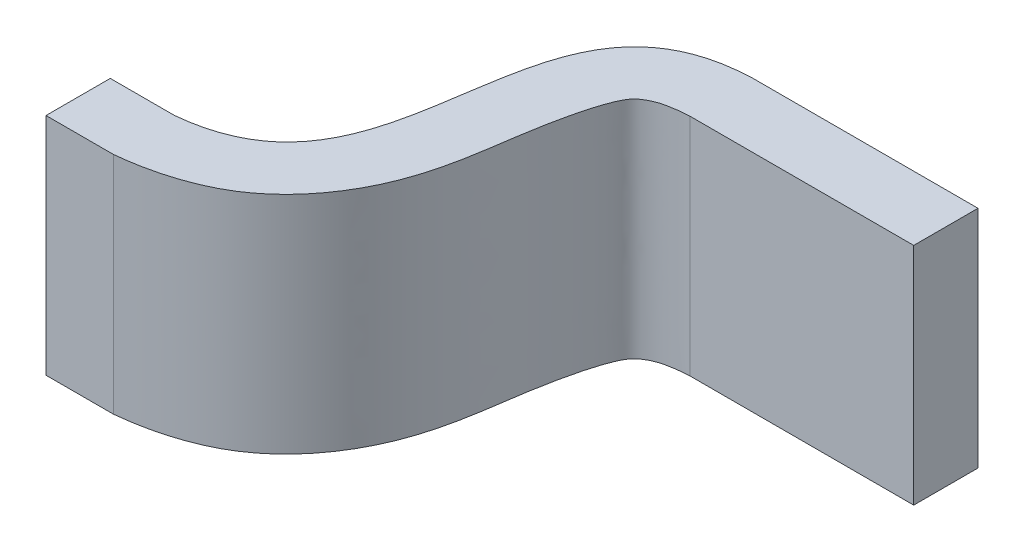
ISO-10303-21;
HEADER;
FILE_DESCRIPTION(('STEP AP214'),'2;1');
FILE_NAME('part.step','',(''),(''),'','','');
FILE_SCHEMA(('AUTOMOTIVE_DESIGN { 1 0 10303 214 1 1 1 1 }'));
ENDSEC;
DATA;
#1=APPLICATION_CONTEXT('core data for automotive mechanical design processes');
#2=APPLICATION_PROTOCOL_DEFINITION('international standard','automotive_design',2000,#1);
#3=PRODUCT_CONTEXT('',#1,'mechanical');
#4=PRODUCT('Part','Part','',(#3));
#5=PRODUCT_RELATED_PRODUCT_CATEGORY('part','',(#4));
#6=PRODUCT_DEFINITION_FORMATION('','',#4);
#7=PRODUCT_DEFINITION_CONTEXT('part definition',#1,'design');
#8=PRODUCT_DEFINITION('design','',#6,#7);
#9=PRODUCT_DEFINITION_SHAPE('','',#8);
#10=(LENGTH_UNIT() NAMED_UNIT(*) SI_UNIT(.MILLI.,.METRE.));
#11=(NAMED_UNIT(*) PLANE_ANGLE_UNIT() SI_UNIT($,.RADIAN.));
#12=(NAMED_UNIT(*) SI_UNIT($,.STERADIAN.) SOLID_ANGLE_UNIT());
#13=UNCERTAINTY_MEASURE_WITH_UNIT(LENGTH_MEASURE(1.E-05),#10,'distance_accuracy_value','');
#14=(GEOMETRIC_REPRESENTATION_CONTEXT(3) GLOBAL_UNCERTAINTY_ASSIGNED_CONTEXT((#13)) GLOBAL_UNIT_ASSIGNED_CONTEXT((#10,
#11,#12)) REPRESENTATION_CONTEXT('',''));
#15=CARTESIAN_POINT('',(0.,0.,0.));
#16=DIRECTION('',(0.,0.,1.));
#17=DIRECTION('',(1.,0.,0.));
#18=AXIS2_PLACEMENT_3D('',#15,#16,#17);
#19=CARTESIAN_POINT('',(0.381074398756027,-3.47690082967439,1.19999985356685));
#20=DIRECTION('',(0.,1.,4.37113882867379E-08));
#21=DIRECTION('',(-1.,0.,0.));
#22=AXIS2_PLACEMENT_3D('',#19,#20,#21);
#23=PLANE('',#22);
#24=DIRECTION('',(-1.,0.,0.));
#25=VECTOR('',#24,1.);
#26=CARTESIAN_POINT('',(8.91607439875603,-3.476900785963,0.199999853566849));
#27=LINE('',#26,#25);
#28=CARTESIAN_POINT('',(8.91607439875603,-3.476900785963,0.199999853566849));
#29=VERTEX_POINT('',#28);
#30=CARTESIAN_POINT('',(8.21957818049203,-3.476900785963,0.199999853566849));
#31=VERTEX_POINT('',#30);
#32=EDGE_CURVE('E11',#29,#31,#27,.T.);
#33=ORIENTED_EDGE('',*,*,#32,.T.);
#34=CARTESIAN_POINT('',(7.42587357560403,-3.47690082967439,1.19999985356685));
#35=CARTESIAN_POINT('',(7.44450696231857,-3.47690082959388,1.19815800024526));
#36=CARTESIAN_POINT('',(7.46308378697548,-3.47690082948649,1.1957012238173));
#37=CARTESIAN_POINT('',(7.50006101029373,-3.47690082921529,1.18949682423011));
#38=CARTESIAN_POINT('',(7.51846094169025,-3.47690082905135,1.18574642673535));
#39=CARTESIAN_POINT('',(7.55510393371643,-3.47690082866298,1.1768614504023));
#40=CARTESIAN_POINT('',(7.57334409155655,-3.47690082843801,1.17171471620827));
#41=CARTESIAN_POINT('',(7.60932052096594,-3.47690082792288,1.15992992349783));
#42=CARTESIAN_POINT('',(7.62705717651152,-3.47690082763277,1.15329303778762));
#43=CARTESIAN_POINT('',(7.66764342416262,-3.47690082686923,1.13582532460973));
#44=CARTESIAN_POINT('',(7.69022170006956,-3.47690082636693,1.12433411949994));
#45=CARTESIAN_POINT('',(7.73311709417893,-3.4769008252108,1.09788489937366));
#46=CARTESIAN_POINT('',(7.75344430120095,-3.47690082455769,1.08294336266544));
#47=CARTESIAN_POINT('',(7.79010917597914,-3.4769008231845,1.05152836561377));
#48=CARTESIAN_POINT('',(7.80663564372868,-3.47690082247389,1.03527166959651));
#49=CARTESIAN_POINT('',(7.83757005773215,-3.47690082096671,1.00079135092782));
#50=CARTESIAN_POINT('',(7.85197241919277,-3.47690082016992,0.98256275412625));
#51=CARTESIAN_POINT('',(7.8802341685402,-3.47690081841041,0.942309972603253));
#52=CARTESIAN_POINT('',(7.89381844801596,-3.47690081743928,0.920093186124081));
#53=CARTESIAN_POINT('',(7.91820429984428,-3.47690081543449,0.87422897098033));
#54=CARTESIAN_POINT('',(7.92900959422008,-3.47690081440092,0.850583508813256));
#55=CARTESIAN_POINT('',(7.94871551674147,-3.47690081220073,0.800248980346848));
#56=CARTESIAN_POINT('',(7.95738403816721,-3.47690081103018,0.773470089068371));
#57=CARTESIAN_POINT('',(7.97210425943558,-3.47690080865782,0.719196833192922));
#58=CARTESIAN_POINT('',(7.97815277621527,-3.47690080745597,0.691701641089337));
#59=CARTESIAN_POINT('',(7.98659346655188,-3.47690080548969,0.646718436338351));
#60=CARTESIAN_POINT('',(7.98950808079972,-3.47690080472924,0.629321297123909));
#61=CARTESIAN_POINT('',(7.99495752836008,-3.47690080320562,0.594464888859919));
#62=CARTESIAN_POINT('',(7.99749227542006,-3.47690080244245,0.577005606618712));
#63=CARTESIAN_POINT('',(8.00258019010342,-3.47690080091635,0.542092659422764));
#64=CARTESIAN_POINT('',(8.00513335408043,-3.47690080015343,0.524638994034043));
#65=CARTESIAN_POINT('',(8.01067664140315,-3.47690079863081,0.48980544840022));
#66=CARTESIAN_POINT('',(8.01366664660187,-3.47690079787111,0.472425549508169));
#67=CARTESIAN_POINT('',(8.02154183196176,-3.47690079601736,0.430016740032558));
#68=CARTESIAN_POINT('',(8.026677647503,-3.47690079492524,0.405032011816052));
#69=CARTESIAN_POINT('',(8.03549422069925,-3.47690079329834,0.36781273498558));
#70=CARTESIAN_POINT('',(8.03861929488698,-3.47690079275781,0.35544681434155));
#71=CARTESIAN_POINT('',(8.04538178604434,-3.47690079168298,0.33085792341073));
#72=CARTESIAN_POINT('',(8.04901891512481,-3.47690079114867,0.318634876950398));
#73=CARTESIAN_POINT('',(8.05549287491962,-3.47690079030677,0.299373221215939));
#74=CARTESIAN_POINT('',(8.05805542449796,-3.47690078999518,0.292243807444688));
#75=CARTESIAN_POINT('',(8.06363353655652,-3.47690078937994,0.278171719353253));
#76=CARTESIAN_POINT('',(8.06664841291152,-3.47690078907628,0.27122878066356));
#77=CARTESIAN_POINT('',(8.07291634166038,-3.47690078854217,0.258999768411459));
#78=CARTESIAN_POINT('',(8.07602245220972,-3.47690078830855,0.253644591727609));
#79=CARTESIAN_POINT('',(8.08295261429228,-3.47690078789956,0.24431585073112));
#80=CARTESIAN_POINT('',(8.08664880136107,-3.47690078772056,0.240253829951384));
#81=CARTESIAN_POINT('',(8.09609777114538,-3.47690078736822,0.232075819782313));
#82=CARTESIAN_POINT('',(8.10213521795419,-3.47690078721245,0.228303905554504));
#83=CARTESIAN_POINT('',(8.11135187843241,-3.47690078697539,0.223112945284578));
#84=CARTESIAN_POINT('',(8.11443840401739,-3.47690078689613,0.221466013892202));
#85=CARTESIAN_POINT('',(8.12072868843963,-3.47690078677323,0.218417225329415));
#86=CARTESIAN_POINT('',(8.12393212492761,-3.4769007867295,0.217014747998717));
#87=CARTESIAN_POINT('',(8.1330523200996,-3.4769007866004,0.21346489598315));
#88=CARTESIAN_POINT('',(8.13908573097743,-3.47690078650972,0.211621552848283));
#89=CARTESIAN_POINT('',(8.14885449437696,-3.4769007863772,0.209137060916209));
#90=CARTESIAN_POINT('',(8.15254767389704,-3.4769007863303,0.208309546645722));
#91=CARTESIAN_POINT('',(8.15996325473587,-3.47690078625616,0.206799511724329));
#92=CARTESIAN_POINT('',(8.16368565174552,-3.47690078622893,0.206116970094036));
#93=CARTESIAN_POINT('',(8.17604847837331,-3.47690078614263,0.204031929793531));
#94=CARTESIAN_POINT('',(8.18472828231269,-3.47690078608874,0.20286096389716));
#95=CARTESIAN_POINT('',(8.19777924698608,-3.47690078602721,0.201476448842085));
#96=CARTESIAN_POINT('',(8.20213187370674,-3.47690078600992,0.201077075020748));
#97=CARTESIAN_POINT('',(8.2108475193358,-3.4769007859817,0.200423844313514));
#98=CARTESIAN_POINT('',(8.21521053727932,-3.47690078597078,0.200169974408029));
#99=CARTESIAN_POINT('',(8.21957818049203,-3.476900785963,0.199999853566849));
#100=B_SPLINE_CURVE_WITH_KNOTS('',3,(#34,#35,#36,#37,#38,#39,#40,#41,#42,#43,#44,#45,#46,#47,
#48,#49,#50,#51,#52,#53,#54,#55,#56,#57,#58,#59,#60,#61,#62,#63,#64,#65,#66,#67,#68,#69,#70,#71,
#72,#73,#74,#75,#76,#77,#78,#79,#80,#81,#82,#83,#84,#85,#86,#87,#88,#89,#90,#91,#92,#93,#94,#95,
#96,#97,#98,#99),.UNSPECIFIED.,.F.,.F.,(4,2,2,2,2,2,2,2,2,2,2,2,2,2,2,2,2,2,2,2,2,2,2,2,2,2,2,2,
2,2,2,2,4),(0.,0.0561681589095689,0.112457534383133,0.169253578612362,0.226005077906876,
0.301715004036535,0.377070566345992,0.446424912055148,0.515958475234814,0.593880428548582,
0.671697467408242,0.755964517163008,0.840333658382208,0.893247792631838,0.946173923407369,
0.999089848164161,1.05199148781442,1.12847716172405,1.16673541076623,1.20497223539783,
1.22769072756634,1.25037510056687,1.26886797593494,1.28517999290264,1.30634908955326,
1.31685139211729,1.32732665061525,1.34619861049413,1.3575513722042,1.36890248990408,
1.39515927363249,1.40827024085607,1.42138003473644),.UNSPECIFIED.);
#101=CARTESIAN_POINT('',(7.42587357560403,-3.47690082967439,1.19999985356685));
#102=VERTEX_POINT('',#101);
#103=EDGE_CURVE('E187',#102,#31,#100,.T.);
#104=ORIENTED_EDGE('',*,*,#103,.F.);
#105=DIRECTION('',(1.,0.,0.));
#106=VECTOR('',#105,1.);
#107=CARTESIAN_POINT('',(7.21607439875603,-3.47690082967439,1.19999985356685));
#108=LINE('',#107,#106);
#109=CARTESIAN_POINT('',(7.21607439875603,-3.47690082967439,1.19999985356685));
#110=VERTEX_POINT('',#109);
#111=EDGE_CURVE('E163',#110,#102,#108,.T.);
#112=ORIENTED_EDGE('',*,*,#111,.F.);
#113=DIRECTION('',(0.,4.37113878426487E-08,-0.999999999999999));
#114=VECTOR('',#113,1.);
#115=CARTESIAN_POINT('',(7.21607439875603,-3.47690082967439,1.19999985356685));
#116=LINE('',#115,#114);
#117=CARTESIAN_POINT('',(7.21607439875603,-3.47690082093211,0.999999853566849));
#118=VERTEX_POINT('',#117);
#119=EDGE_CURVE('E155',#110,#118,#116,.T.);
#120=ORIENTED_EDGE('',*,*,#119,.T.);
#121=DIRECTION('',(1.,0.,0.));
#122=VECTOR('',#121,1.);
#123=CARTESIAN_POINT('',(7.21607439875603,-3.47690082093211,0.999999853566849));
#124=LINE('',#123,#122);
#125=CARTESIAN_POINT('',(7.41607439875603,-3.47690082093211,0.999999853566849));
#126=VERTEX_POINT('',#125);
#127=EDGE_CURVE('E148',#118,#126,#124,.T.);
#128=ORIENTED_EDGE('',*,*,#127,.T.);
#129=CARTESIAN_POINT('',(7.41607439875603,-3.47690082093211,0.999999853566849));
#130=CARTESIAN_POINT('',(7.43817018222186,-3.47690082083689,0.997821363378806));
#131=CARTESIAN_POINT('',(7.46028248507753,-3.4769008206928,0.994524992319807));
#132=CARTESIAN_POINT('',(7.50409640205193,-3.47690082027531,0.984973999806054));
#133=CARTESIAN_POINT('',(7.52579079095056,-3.4769008200005,0.978687133446074));
#134=CARTESIAN_POINT('',(7.56323568888655,-3.476900819368,0.964217061903684));
#135=CARTESIAN_POINT('',(7.57925238017961,-3.47690081904135,0.956744157681286));
#136=CARTESIAN_POINT('',(7.60984744345818,-3.47690081828303,0.939395910983818));
#137=CARTESIAN_POINT('',(7.62443222356208,-3.47690081785186,0.929532028551955));
#138=CARTESIAN_POINT('',(7.65127355429857,-3.47690081690445,0.907857820702244));
#139=CARTESIAN_POINT('',(7.66359189311382,-3.47690081639156,0.896124080689934));
#140=CARTESIAN_POINT('',(7.68623973177649,-3.47690081528685,0.870851202194944));
#141=CARTESIAN_POINT('',(7.69656581930069,-3.4769008146949,0.857309032186524));
#142=CARTESIAN_POINT('',(7.7288599653506,-3.47690081254812,0.808196393991892));
#143=CARTESIAN_POINT('',(7.74578219402698,-3.47690081085059,0.769361408858454));
#144=CARTESIAN_POINT('',(7.76851555094968,-3.47690080782166,0.700067620687222));
#145=CARTESIAN_POINT('',(7.77606917338715,-3.47690080650928,0.670043871769164));
#146=CARTESIAN_POINT('',(7.78894702253641,-3.476900803861,0.609458291277652));
#147=CARTESIAN_POINT('',(7.79426746653087,-3.47690080252507,0.578895637360987));
#148=CARTESIAN_POINT('',(7.80737252762368,-3.47690079894623,0.497021351625422));
#149=CARTESIAN_POINT('',(7.81440202819144,-3.47690079669872,0.445604528778748));
#150=CARTESIAN_POINT('',(7.82797469405163,-3.47690079334914,0.368975045837081));
#151=CARTESIAN_POINT('',(7.83300116933564,-3.47690079223664,0.343524079365539));
#152=CARTESIAN_POINT('',(7.8450377099592,-3.47690079003342,0.293120201610463));
#153=CARTESIAN_POINT('',(7.85204451695726,-3.47690078894266,0.268166543683048));
#154=CARTESIAN_POINT('',(7.86967882133572,-3.4769007867616,0.218269493752244));
#155=CARTESIAN_POINT('',(7.88044603179669,-3.47690078567323,0.19337055401301));
#156=CARTESIAN_POINT('',(7.90028149828643,-3.47690078413505,0.158181114031214));
#157=CARTESIAN_POINT('',(7.90747873152155,-3.47690078363948,0.146843820328248));
#158=CARTESIAN_POINT('',(7.92319628097518,-3.47690078269053,0.125134406221759));
#159=CARTESIAN_POINT('',(7.93171533183735,-3.47690078223712,0.114761377771714));
#160=CARTESIAN_POINT('',(7.95305079729199,-3.47690078124645,0.0920974605824842));
#161=CARTESIAN_POINT('',(7.96636683173803,-3.47690078072935,0.0802678988908218));
#162=CARTESIAN_POINT('',(7.9949416924925,-3.47690077980915,0.0592160823492707));
#163=CARTESIAN_POINT('',(8.01020376688035,-3.47690077940623,0.0499982715306271));
#164=CARTESIAN_POINT('',(8.04269320473982,-3.47690077870131,0.03387168882075));
#165=CARTESIAN_POINT('',(8.059976592337,-3.47690077840435,0.0270780092305779));
#166=CARTESIAN_POINT('',(8.09534530324317,-3.47690077791998,0.0159969269530985));
#167=CARTESIAN_POINT('',(8.11343240408648,-3.47690077773283,0.011715410814513));
#168=CARTESIAN_POINT('',(8.14567062680494,-3.4769007774817,0.00597036540082552));
#169=CARTESIAN_POINT('',(8.15975136088267,-3.47690077739915,0.00408168117578882));
#170=CARTESIAN_POINT('',(8.18791264005314,-3.4769007772789,0.00133069078066405));
#171=CARTESIAN_POINT('',(8.2019924559053,-3.47690077724089,0.000461089362856563));
#172=CARTESIAN_POINT('',(8.21607439875606,-3.47690077722073,-1.46433151940948E-07));
#173=B_SPLINE_CURVE_WITH_KNOTS('',3,(#129,#130,#131,#132,#133,#134,#135,#136,#137,#138,#139,
#140,#141,#142,#143,#144,#145,#146,#147,#148,#149,#150,#151,#152,#153,#154,#155,#156,#157,#158,
#159,#160,#161,#162,#163,#164,#165,#166,#167,#168,#169,#170,#171,#172),.UNSPECIFIED.,.F.,.F.,(4,
2,2,2,2,2,2,2,2,2,2,2,2,2,2,2,2,2,2,2,2,4),(0.,0.0667821137090817,0.134301214684023,
0.18712850882399,0.239707439757743,0.29051873145293,0.341416294675054,0.466712259088969,
0.559563019654506,0.652570428897919,0.808245450373593,0.886023921415194,0.963675157190786,
1.04458784966541,1.08478909463836,1.12495209032637,1.17807587168456,1.23128951042009,
1.2867700351769,1.34238004906254,1.38496468867344,1.42724258099922),.UNSPECIFIED.);
#174=CARTESIAN_POINT('',(8.21607439875603,-3.47690077722073,-1.46433150760572E-07));
#175=VERTEX_POINT('',#174);
#176=EDGE_CURVE('E100',#126,#175,#173,.T.);
#177=ORIENTED_EDGE('',*,*,#176,.T.);
#178=DIRECTION('',(1.,0.,0.));
#179=VECTOR('',#178,1.);
#180=CARTESIAN_POINT('',(8.21607439875603,-3.47690077722073,-1.46433150760572E-07));
#181=LINE('',#180,#179);
#182=CARTESIAN_POINT('',(8.91607439875603,-3.47690077722073,-1.46433150760572E-07));
#183=VERTEX_POINT('',#182);
#184=EDGE_CURVE('E94',#175,#183,#181,.T.);
#185=ORIENTED_EDGE('',*,*,#184,.T.);
#186=DIRECTION('',(0.,4.37113900630947E-08,-0.999999999999999));
#187=VECTOR('',#186,1.);
#188=CARTESIAN_POINT('',(8.91607439875603,-3.476900785963,0.199999853566849));
#189=LINE('',#188,#187);
#190=EDGE_CURVE('E195',#29,#183,#189,.T.);
#191=ORIENTED_EDGE('',*,*,#190,.F.);
#192=EDGE_LOOP('',(#33,#104,#112,#120,#128,#177,#185,#191));
#193=FACE_BOUND('',#192,.T.);
#194=ADVANCED_FACE('F17',(#193),#23,.F.);
#195=CARTESIAN_POINT('',(8.91607439875603,-0.126900829674392,1.2));
#196=DIRECTION('',(-1.,0.,0.));
#197=DIRECTION('',(0.,-1.,-4.37113882867379E-08));
#198=AXIS2_PLACEMENT_3D('',#195,#196,#197);
#199=PLANE('',#198);
#200=DIRECTION('',(0.,-0.999999999999999,-4.37113886356658E-08));
#201=VECTOR('',#200,1.);
#202=CARTESIAN_POINT('',(8.91607439875603,-2.77690078596301,0.199999884164821));
#203=LINE('',#202,#201);
#204=CARTESIAN_POINT('',(8.91607439875603,-2.776900785963,0.199999884164821));
#205=VERTEX_POINT('',#204);
#206=EDGE_CURVE('E25',#205,#29,#203,.T.);
#207=ORIENTED_EDGE('',*,*,#206,.T.);
#208=ORIENTED_EDGE('',*,*,#190,.T.);
#209=DIRECTION('',(0.,0.999999999999999,4.37113882867379E-08));
#210=VECTOR('',#209,1.);
#211=CARTESIAN_POINT('',(8.91607439875602,-3.47690077722073,-1.46433150760572E-07));
#212=LINE('',#211,#210);
#213=CARTESIAN_POINT('',(8.91607439875603,-2.77690077722073,-1.15835178959856E-07));
#214=VERTEX_POINT('',#213);
#215=EDGE_CURVE('E157',#183,#214,#212,.T.);
#216=ORIENTED_EDGE('',*,*,#215,.T.);
#217=DIRECTION('',(0.,4.37113878426487E-08,-0.999999999999999));
#218=VECTOR('',#217,1.);
#219=CARTESIAN_POINT('',(8.91607439875603,-2.776900785963,0.199999884164821));
#220=LINE('',#219,#218);
#221=EDGE_CURVE('E150',#205,#214,#220,.T.);
#222=ORIENTED_EDGE('',*,*,#221,.F.);
#223=EDGE_LOOP('',(#207,#208,#216,#222));
#224=FACE_BOUND('',#223,.T.);
#225=ADVANCED_FACE('F207',(#224),#199,.F.);
#226=CARTESIAN_POINT('',(0.381074398756027,-2.77690082967439,1.19999988416482));
#227=DIRECTION('',(0.,1.,4.37113882867379E-08));
#228=DIRECTION('',(-1.,0.,0.));
#229=AXIS2_PLACEMENT_3D('',#226,#227,#228);
#230=PLANE('',#229);
#231=CARTESIAN_POINT('',(8.21957818049203,-2.77690078596301,0.199999884164821));
#232=CARTESIAN_POINT('',(8.21401047042364,-2.77690078597274,0.200222545274548));
#233=CARTESIAN_POINT('',(8.2084492375196,-2.77690078598803,0.20057241023223));
#234=CARTESIAN_POINT('',(8.19734075645456,-2.7769007860286,0.201500542733154));
#235=CARTESIAN_POINT('',(8.19179352491144,-2.77690078605388,0.202079011044646));
#236=CARTESIAN_POINT('',(8.1806812900785,-2.77690078611351,0.203443090764305));
#237=CARTESIAN_POINT('',(8.17511647873244,-2.77690078614792,0.204230262557151));
#238=CARTESIAN_POINT('',(8.16402483417435,-2.77690078622667,0.206031793785162));
#239=CARTESIAN_POINT('',(8.15849799412172,-2.776900786271,0.207046111131485));
#240=CARTESIAN_POINT('',(8.14658674806992,-2.77690078638383,0.209627208268326));
#241=CARTESIAN_POINT('',(8.14021486717337,-2.77690078645515,0.211258301325648));
#242=CARTESIAN_POINT('',(8.12922884181096,-2.77690078661369,0.214886050566055));
#243=CARTESIAN_POINT('',(8.12455816053053,-2.77690078669306,0.216702528900894));
#244=CARTESIAN_POINT('',(8.11576316126025,-2.77690078686976,0.22074290890376));
#245=CARTESIAN_POINT('',(8.11162296951039,-2.77690078696563,0.222933797612516));
#246=CARTESIAN_POINT('',(8.10254423156373,-2.77690078719131,0.228105057200504));
#247=CARTESIAN_POINT('',(8.09763875402522,-2.77690078732386,0.231151563888761));
#248=CARTESIAN_POINT('',(8.09023645619511,-2.77690078758199,0.237031262748701));
#249=CARTESIAN_POINT('',(8.08750404217203,-2.77690078769324,0.23955395444284));
#250=CARTESIAN_POINT('',(8.08247327048636,-2.77690078792886,0.245002599685693));
#251=CARTESIAN_POINT('',(8.08017570164472,-2.77690078805326,0.247929269748008));
#252=CARTESIAN_POINT('',(8.07600750655781,-2.77690078831818,0.253960404586634));
#253=CARTESIAN_POINT('',(8.0741279129576,-2.77690078845825,0.257058872068496));
#254=CARTESIAN_POINT('',(8.07061884711942,-2.77690078873287,0.263392751592161));
#255=CARTESIAN_POINT('',(8.06898949912774,-2.77690078886743,0.266628230649384));
#256=CARTESIAN_POINT('',(8.06368568552224,-2.77690078933829,0.27784972975488));
#257=CARTESIAN_POINT('',(8.0604132563502,-2.77690078968831,0.286021915952384));
#258=CARTESIAN_POINT('',(8.05219767575064,-2.77690079066703,0.30842202736659));
#259=CARTESIAN_POINT('',(8.04772694785476,-2.77690079131651,0.322813120641394));
#260=CARTESIAN_POINT('',(8.03962993037268,-2.7769007925869,0.351469785882451));
#261=CARTESIAN_POINT('',(8.03598677320327,-2.77690079320814,0.36573078949332));
#262=CARTESIAN_POINT('',(8.0292057912753,-2.77690079445803,0.394362004356698));
#263=CARTESIAN_POINT('',(8.026067670572,-2.77690079508669,0.408732146447141));
#264=CARTESIAN_POINT('',(8.01737649852023,-2.77690079694117,0.451139407892785));
#265=CARTESIAN_POINT('',(8.01233758089064,-2.77690079817098,0.479282620997366));
#266=CARTESIAN_POINT('',(8.0033688768371,-2.77690080064164,0.535811059461234));
#267=CARTESIAN_POINT('',(7.99944209123785,-2.77690080188252,0.564196730647227));
#268=CARTESIAN_POINT('',(7.99171406777027,-2.77690080413515,0.615729651786948));
#269=CARTESIAN_POINT('',(7.98801955213797,-2.77690080514759,0.638891994813739));
#270=CARTESIAN_POINT('',(7.97944793328662,-2.77690080716327,0.685005694258186));
#271=CARTESIAN_POINT('',(7.97457098452208,-2.77690080816652,0.7079570778262));
#272=CARTESIAN_POINT('',(7.96312511462686,-2.7769008101499,0.753331482858814));
#273=CARTESIAN_POINT('',(7.95656434385539,-2.77690081113012,0.775756496819386));
#274=CARTESIAN_POINT('',(7.94138023978948,-2.77690081305942,0.819893535968631));
#275=CARTESIAN_POINT('',(7.93275798105253,-2.77690081400849,0.841605925931371));
#276=CARTESIAN_POINT('',(7.91045031887107,-2.77690081613078,0.890158260432963));
#277=CARTESIAN_POINT('',(7.89602176505836,-2.77690081728932,0.916662526770147));
#278=CARTESIAN_POINT('',(7.86348674764205,-2.77690081950771,0.967413287010705));
#279=CARTESIAN_POINT('',(7.84537217243352,-2.77690082056733,0.991654626364154));
#280=CARTESIAN_POINT('',(7.80791242379023,-2.77690082242581,1.03417149020099));
#281=CARTESIAN_POINT('',(7.78898672481745,-2.7769008232407,1.05281403345911));
#282=CARTESIAN_POINT('',(7.74845805610151,-2.77690082472744,1.08682684057684));
#283=CARTESIAN_POINT('',(7.72686395650978,-2.77690082539975,1.10220750767774));
#284=CARTESIAN_POINT('',(7.68360712676314,-2.77690082651875,1.1278071446038));
#285=CARTESIAN_POINT('',(7.66215097272193,-2.77690082698092,1.13838039934658));
#286=CARTESIAN_POINT('',(7.61807803282735,-2.77690082779152,1.1569247779375));
#287=CARTESIAN_POINT('',(7.59545709543128,-2.7769008281395,1.16488572377528));
#288=CARTESIAN_POINT('',(7.54849735175117,-2.77690082874837,1.17881496183062));
#289=CARTESIAN_POINT('',(7.52412722595024,-2.77690082900456,1.18467600751106));
#290=CARTESIAN_POINT('',(7.47515350623731,-2.77690082941338,1.19402853971284));
#291=CARTESIAN_POINT('',(7.45055381030962,-2.77690082956688,1.19754027436313));
#292=CARTESIAN_POINT('',(7.42587357560403,-2.77690082967439,1.19999988416482));
#293=B_SPLINE_CURVE_WITH_KNOTS('',3,(#231,#232,#233,#234,#235,#236,#237,#238,#239,#240,#241,
#242,#243,#244,#245,#246,#247,#248,#249,#250,#251,#252,#253,#254,#255,#256,#257,#258,#259,#260,
#261,#262,#263,#264,#265,#266,#267,#268,#269,#270,#271,#272,#273,#274,#275,#276,#277,#278,#279,
#280,#281,#282,#283,#284,#285,#286,#287,#288,#289,#290,#291,#292),.UNSPECIFIED.,.F.,.F.,(4,2,2,
2,2,2,2,2,2,2,2,2,2,2,2,2,2,2,2,2,2,2,2,2,2,2,2,2,2,2,4),(0.,0.0167129049826609,
0.0334405206169318,0.0502969119078533,0.0671501823813418,0.0868449977925692,0.101838970321099,
0.115885127156854,0.133132127804881,0.144236213112227,0.155360252414291,0.166215762863011,
0.177076645740441,0.203446553112075,0.248618617741088,0.292765096579108,0.336885611219408,
0.422622380023031,0.508588331833523,0.578941414817059,0.649285312924706,0.719294937731853,
0.789268149044615,0.879502218060828,0.969937050040227,1.04934324822106,1.12849225200604,
1.200024637838,1.27183250557101,1.34691026454656,1.42133231106535),.UNSPECIFIED.);
#294=CARTESIAN_POINT('',(8.21957818049203,-2.776900785963,0.199999884164821));
#295=VERTEX_POINT('',#294);
#296=CARTESIAN_POINT('',(7.42587357560403,-2.77690082967439,1.19999988416482));
#297=VERTEX_POINT('',#296);
#298=EDGE_CURVE('E181',#295,#297,#293,.T.);
#299=ORIENTED_EDGE('',*,*,#298,.F.);
#300=DIRECTION('',(1.,0.,0.));
#301=VECTOR('',#300,1.);
#302=CARTESIAN_POINT('',(8.21957818049203,-2.77690078596301,0.199999884164821));
#303=LINE('',#302,#301);
#304=EDGE_CURVE('E159',#295,#205,#303,.T.);
#305=ORIENTED_EDGE('',*,*,#304,.T.);
#306=ORIENTED_EDGE('',*,*,#221,.T.);
#307=DIRECTION('',(1.,0.,0.));
#308=VECTOR('',#307,1.);
#309=CARTESIAN_POINT('',(8.21607439875603,-2.77690077722073,-1.15835178959856E-07));
#310=LINE('',#309,#308);
#311=CARTESIAN_POINT('',(8.21607439875603,-2.77690077722073,-1.15835178959856E-07));
#312=VERTEX_POINT('',#311);
#313=EDGE_CURVE('E90',#312,#214,#310,.T.);
#314=ORIENTED_EDGE('',*,*,#313,.F.);
#315=CARTESIAN_POINT('',(8.21607439875603,-2.77690077722073,-1.15835178989218E-07));
#316=CARTESIAN_POINT('',(8.19359750090305,-2.77690077725359,0.000751828798226361));
#317=CARTESIAN_POINT('',(8.17102033253113,-2.77690077733127,0.00252878210818467));
#318=CARTESIAN_POINT('',(8.12598549255526,-2.77690077761353,0.00898616856351775));
#319=CARTESIAN_POINT('',(8.10353378116303,-2.77690077781986,0.0137063757408221));
#320=CARTESIAN_POINT('',(8.06516605596456,-2.77690077832605,0.0252867766409522));
#321=CARTESIAN_POINT('',(8.04901169028135,-2.77690077858996,0.0313243554019526));
#322=CARTESIAN_POINT('',(8.01790380459713,-2.77690077922343,0.0458163888177902));
#323=CARTESIAN_POINT('',(8.00294442627384,-2.77690077959243,0.0542579905386405));
#324=CARTESIAN_POINT('',(7.97582167191426,-2.77690078040506,0.0728487695511766));
#325=CARTESIAN_POINT('',(7.96353091436025,-2.77690078084053,0.0828113454701648));
#326=CARTESIAN_POINT('',(7.94070621502396,-2.77690078179279,0.104596489718875));
#327=CARTESIAN_POINT('',(7.93017445817697,-2.77690078230967,0.116421336371777));
#328=CARTESIAN_POINT('',(7.90935508116188,-2.7769007834979,0.143604933637192));
#329=CARTESIAN_POINT('',(7.89940970116877,-2.7769007841806,0.159223162210517));
#330=CARTESIAN_POINT('',(7.88179108799282,-2.77690078560041,0.191704792958367));
#331=CARTESIAN_POINT('',(7.8741236490106,-2.77690078633767,0.208571236417005));
#332=CARTESIAN_POINT('',(7.85832464058284,-2.77690078809626,0.248803200856694));
#333=CARTESIAN_POINT('',(7.85090890706548,-2.77690078912954,0.272441889034486));
#334=CARTESIAN_POINT('',(7.83820894045457,-2.77690079121847,0.320230895727309));
#335=CARTESIAN_POINT('',(7.8329235985232,-2.7769007922741,0.344380941180813));
#336=CARTESIAN_POINT('',(7.82020763349267,-2.77690079514812,0.410130810181528));
#337=CARTESIAN_POINT('',(7.81392194525157,-2.7769007969754,0.451934170412704));
#338=CARTESIAN_POINT('',(7.80124280837881,-2.77690080063979,0.535765697035457));
#339=CARTESIAN_POINT('',(7.79484895474966,-2.77690080247691,0.577793820022284));
#340=CARTESIAN_POINT('',(7.782739848071,-2.77690080516847,0.63936961692802));
#341=CARTESIAN_POINT('',(7.77842057810017,-2.77690080603403,0.659171551216423));
#342=CARTESIAN_POINT('',(7.76847573352189,-2.77690080775189,0.698471606542055));
#343=CARTESIAN_POINT('',(7.76284917548215,-2.77690080860417,0.717969487006552));
#344=CARTESIAN_POINT('',(7.74981596903729,-2.77690081027332,0.756155132995517));
#345=CARTESIAN_POINT('',(7.74242864611761,-2.77690081109047,0.774849258083352));
#346=CARTESIAN_POINT('',(7.72530005700015,-2.77690081267529,0.811105816529293));
#347=CARTESIAN_POINT('',(7.71556458954354,-2.77690081344308,0.828670904766428));
#348=CARTESIAN_POINT('',(7.69292951988902,-2.77690081492352,0.862539384455968));
#349=CARTESIAN_POINT('',(7.67993520495926,-2.77690081563347,0.878781145734714));
#350=CARTESIAN_POINT('',(7.65100399267901,-2.77690081692778,0.908391244468529));
#351=CARTESIAN_POINT('',(7.63506980602137,-2.77690081751224,0.92176220455503));
#352=CARTESIAN_POINT('',(7.60252456066282,-2.77690081848615,0.944042697605553));
#353=CARTESIAN_POINT('',(7.58611569627056,-2.77690081888871,0.953252270237818));
#354=CARTESIAN_POINT('',(7.55201487673193,-2.77690081957839,0.969030296795617));
#355=CARTESIAN_POINT('',(7.53431790582258,-2.77690081986502,0.975587694142394));
#356=CARTESIAN_POINT('',(7.4998876879737,-2.77690082031487,0.985878983079623));
#357=CARTESIAN_POINT('',(7.48321202321778,-2.7769008204869,0.989814590328339));
#358=CARTESIAN_POINT('',(7.44972396115948,-2.77690082075885,0.996036085015086));
#359=CARTESIAN_POINT('',(7.43291463042139,-2.77690082085948,0.998338181632926));
#360=CARTESIAN_POINT('',(7.41607439875603,-2.77690082093212,0.999999884164821));
#361=B_SPLINE_CURVE_WITH_KNOTS('',3,(#315,#316,#317,#318,#319,#320,#321,#322,#323,#324,#325,
#326,#327,#328,#329,#330,#331,#332,#333,#334,#335,#336,#337,#338,#339,#340,#341,#342,#343,#344,
#345,#346,#347,#348,#349,#350,#351,#352,#353,#354,#355,#356,#357,#358,#359,#360),.UNSPECIFIED.,
.F.,.F.,(4,2,2,2,2,2,2,2,2,2,2,2,2,2,2,2,2,2,2,2,2,2,4),(0.,0.0676605368254357,
0.136255841823746,0.187815232472052,0.239103979458827,0.286357475935169,0.333669238509407,
0.388978971846574,0.444428210357162,0.518581097757567,0.59269533966564,0.719482422739697,
0.846974988060583,0.90774680548486,0.96856448853661,1.02874313069962,1.08877465652058,
1.15080863583324,1.21278570033355,1.26897458836371,1.32539536427915,1.3767136749948,
1.42751535438906),.UNSPECIFIED.);
#362=CARTESIAN_POINT('',(7.41607439875603,-2.77690082093211,0.999999884164821));
#363=VERTEX_POINT('',#362);
#364=EDGE_CURVE('E81',#312,#363,#361,.T.);
#365=ORIENTED_EDGE('',*,*,#364,.T.);
#366=DIRECTION('',(-1.,0.,0.));
#367=VECTOR('',#366,1.);
#368=CARTESIAN_POINT('',(7.41607439875603,-2.77690082093211,0.99999988416482));
#369=LINE('',#368,#367);
#370=CARTESIAN_POINT('',(7.21607439875603,-2.77690082093211,0.999999884164821));
#371=VERTEX_POINT('',#370);
#372=EDGE_CURVE('E86',#363,#371,#369,.T.);
#373=ORIENTED_EDGE('',*,*,#372,.T.);
#374=DIRECTION('',(0.,4.37113878426487E-08,-0.999999999999999));
#375=VECTOR('',#374,1.);
#376=CARTESIAN_POINT('',(7.21607439875603,-2.77690082967439,1.19999988416482));
#377=LINE('',#376,#375);
#378=CARTESIAN_POINT('',(7.21607439875603,-2.77690082967439,1.19999988416482));
#379=VERTEX_POINT('',#378);
#380=EDGE_CURVE('E161',#379,#371,#377,.T.);
#381=ORIENTED_EDGE('',*,*,#380,.F.);
#382=DIRECTION('',(1.,0.,0.));
#383=VECTOR('',#382,1.);
#384=CARTESIAN_POINT('',(7.21607439875603,-2.7769008296744,1.19999988416482));
#385=LINE('',#384,#383);
#386=EDGE_CURVE('E205',#379,#297,#385,.T.);
#387=ORIENTED_EDGE('',*,*,#386,.T.);
#388=EDGE_LOOP('',(#299,#305,#306,#314,#365,#373,#381,#387));
#389=FACE_BOUND('',#388,.T.);
#390=ADVANCED_FACE('F83',(#389),#230,.T.);
#391=CARTESIAN_POINT('',(7.21607439875603,-0.126900829674392,1.2));
#392=DIRECTION('',(-1.,0.,0.));
#393=DIRECTION('',(0.,-1.,-4.37113882867379E-08));
#394=AXIS2_PLACEMENT_3D('',#391,#392,#393);
#395=PLANE('',#394);
#396=ORIENTED_EDGE('',*,*,#380,.T.);
#397=DIRECTION('',(0.,-0.999999999999999,-4.3711388159856E-08));
#398=VECTOR('',#397,1.);
#399=CARTESIAN_POINT('',(7.21607439875603,-2.77690082093212,0.999999884164821));
#400=LINE('',#399,#398);
#401=EDGE_CURVE('E106',#371,#118,#400,.T.);
#402=ORIENTED_EDGE('',*,*,#401,.T.);
#403=ORIENTED_EDGE('',*,*,#119,.F.);
#404=DIRECTION('',(0.,0.999999999999999,4.37113881598552E-08));
#405=VECTOR('',#404,1.);
#406=CARTESIAN_POINT('',(7.21607439875603,-3.47690082967439,1.19999985356685));
#407=LINE('',#406,#405);
#408=EDGE_CURVE('E93',#110,#379,#407,.T.);
#409=ORIENTED_EDGE('',*,*,#408,.T.);
#410=EDGE_LOOP('',(#396,#402,#403,#409));
#411=FACE_BOUND('',#410,.T.);
#412=ADVANCED_FACE('F178',(#411),#395,.T.);
#413=CARTESIAN_POINT('',(0.381074398756027,-0.126900777220726,0.));
#414=DIRECTION('',(0.,-4.37113882867379E-08,1.));
#415=DIRECTION('',(0.,-1.,-4.37113882867379E-08));
#416=AXIS2_PLACEMENT_3D('',#413,#414,#415);
#417=PLANE('',#416);
#418=DIRECTION('',(0.,-0.999999999999999,-4.37113882867379E-08));
#419=VECTOR('',#418,1.);
#420=CARTESIAN_POINT('',(8.21607439875603,-2.77690077722073,-1.15835178959856E-07));
#421=LINE('',#420,#419);
#422=EDGE_CURVE('E153',#312,#175,#421,.T.);
#423=ORIENTED_EDGE('',*,*,#422,.F.);
#424=ORIENTED_EDGE('',*,*,#313,.T.);
#425=ORIENTED_EDGE('',*,*,#215,.F.);
#426=ORIENTED_EDGE('',*,*,#184,.F.);
#427=EDGE_LOOP('',(#423,#424,#425,#426));
#428=FACE_BOUND('',#427,.T.);
#429=ADVANCED_FACE('F129',(#428),#417,.F.);
#430=CARTESIAN_POINT('',(0.381074398756027,-0.126900829674392,1.2));
#431=DIRECTION('',(0.,-4.37113882867379E-08,1.));
#432=DIRECTION('',(0.,-1.,-4.37113882867379E-08));
#433=AXIS2_PLACEMENT_3D('',#430,#431,#432);
#434=PLANE('',#433);
#435=DIRECTION('',(0.,-0.999999999999999,-4.37113881598552E-08));
#436=VECTOR('',#435,1.);
#437=CARTESIAN_POINT('',(7.42587357560403,-2.77690082967439,1.19999988416482));
#438=LINE('',#437,#436);
#439=EDGE_CURVE('E145',#297,#102,#438,.T.);
#440=ORIENTED_EDGE('',*,*,#439,.F.);
#441=ORIENTED_EDGE('',*,*,#386,.F.);
#442=ORIENTED_EDGE('',*,*,#408,.F.);
#443=ORIENTED_EDGE('',*,*,#111,.T.);
#444=EDGE_LOOP('',(#440,#441,#442,#443));
#445=FACE_BOUND('',#444,.T.);
#446=ADVANCED_FACE('F128',(#445),#434,.T.);
#447=CARTESIAN_POINT('',(7.41607439875603,5.01772964056189,1.00000022487894));
#448=CARTESIAN_POINT('',(8.06139179690003,5.01772964333266,0.93661226287194));
#449=CARTESIAN_POINT('',(7.55197768938303,5.01772968333384,0.0214920441178097));
#450=CARTESIAN_POINT('',(8.21607439875603,5.01772968427327,2.24878939694144E-07));
#451=B_SPLINE_CURVE_WITH_KNOTS('',3,(#447,#448,#449,#450),.UNSPECIFIED.,.F.,.F.,(4,4),(0.,1.),.UNSPECIFIED.);
#452=DIRECTION('',(0.,-0.999999999999999,-4.37113882867379E-08));
#453=VECTOR('',#452,1.);
#454=SURFACE_OF_LINEAR_EXTRUSION('',#451,#453);
#455=ORIENTED_EDGE('',*,*,#422,.T.);
#456=ORIENTED_EDGE('',*,*,#176,.F.);
#457=DIRECTION('',(0.,-0.999999999999999,-4.3711388159856E-08));
#458=VECTOR('',#457,1.);
#459=CARTESIAN_POINT('',(7.41607439875602,-2.77690082093212,0.999999884164821));
#460=LINE('',#459,#458);
#461=EDGE_CURVE('E98',#363,#126,#460,.T.);
#462=ORIENTED_EDGE('',*,*,#461,.F.);
#463=ORIENTED_EDGE('',*,*,#364,.F.);
#464=EDGE_LOOP('',(#455,#456,#462,#463));
#465=FACE_BOUND('',#464,.T.);
#466=ADVANCED_FACE('F99',(#465),#454,.T.);
#467=CARTESIAN_POINT('',(0.381074398756027,5.01772964056189,1.00000022487894));
#468=DIRECTION('',(0.,4.37113882867379E-08,-1.));
#469=DIRECTION('',(0.,1.,4.37113882867379E-08));
#470=AXIS2_PLACEMENT_3D('',#467,#468,#469);
#471=PLANE('',#470);
#472=ORIENTED_EDGE('',*,*,#461,.T.);
#473=ORIENTED_EDGE('',*,*,#127,.F.);
#474=ORIENTED_EDGE('',*,*,#401,.F.);
#475=ORIENTED_EDGE('',*,*,#372,.F.);
#476=EDGE_LOOP('',(#472,#473,#474,#475));
#477=FACE_BOUND('',#476,.T.);
#478=ADVANCED_FACE('F104',(#477),#471,.T.);
#479=CARTESIAN_POINT('',(7.42587357560403,5.01772963181961,1.20000022487894));
#480=CARTESIAN_POINT('',(7.52324797711103,5.0177296322377,1.19043537372094));
#481=CARTESIAN_POINT('',(7.72759639244103,5.01772963465043,1.13523848292794));
#482=CARTESIAN_POINT('',(7.96818915500203,5.01772964683219,0.85655227210794));
#483=CARTESIAN_POINT('',(8.00048622477203,5.01772966268883,0.49379478761794));
#484=CARTESIAN_POINT('',(8.06033428941003,5.01772967295241,0.25899132482694));
#485=CARTESIAN_POINT('',(8.09819089651203,5.01772967426447,0.22897490490494));
#486=CARTESIAN_POINT('',(8.14113192410003,5.01772967516896,0.20828275194794));
#487=CARTESIAN_POINT('',(8.19604029615203,5.01772967549165,0.20090043049794));
#488=CARTESIAN_POINT('',(8.21957818049203,5.017729675531,0.20000022487894));
#489=B_SPLINE_CURVE_WITH_KNOTS('',3,(#479,#480,#481,#482,#483,#484,#485,#486,#487,#488),
.UNSPECIFIED.,.F.,.F.,(4,1,1,1,1,1,1,4),(-0.005037439357121,0.120331553469,0.245700546295,
0.496438531947,0.747176517599,0.872545510425,0.935230006838,0.997914503251),.UNSPECIFIED.);
#490=DIRECTION('',(0.,-0.999999999999999,-4.37113882867379E-08));
#491=VECTOR('',#490,1.);
#492=SURFACE_OF_LINEAR_EXTRUSION('',#489,#491);
#493=ORIENTED_EDGE('',*,*,#298,.T.);
#494=ORIENTED_EDGE('',*,*,#439,.T.);
#495=ORIENTED_EDGE('',*,*,#103,.T.);
#496=DIRECTION('',(0.,-0.999999999999999,-4.37113886356658E-08));
#497=VECTOR('',#496,1.);
#498=CARTESIAN_POINT('',(8.21957818049203,-2.77690078596301,0.199999884164821));
#499=LINE('',#498,#497);
#500=EDGE_CURVE('E107',#295,#31,#499,.T.);
#501=ORIENTED_EDGE('',*,*,#500,.F.);
#502=EDGE_LOOP('',(#493,#494,#495,#501));
#503=FACE_BOUND('',#502,.T.);
#504=ADVANCED_FACE('F172',(#503),#492,.F.);
#505=CARTESIAN_POINT('',(0.381074398756027,5.017729675531,0.20000022487894));
#506=DIRECTION('',(0.,-4.37113882867379E-08,1.));
#507=DIRECTION('',(-1.,0.,0.));
#508=AXIS2_PLACEMENT_3D('',#505,#506,#507);
#509=PLANE('',#508);
#510=ORIENTED_EDGE('',*,*,#500,.T.);
#511=ORIENTED_EDGE('',*,*,#32,.F.);
#512=ORIENTED_EDGE('',*,*,#206,.F.);
#513=ORIENTED_EDGE('',*,*,#304,.F.);
#514=EDGE_LOOP('',(#510,#511,#512,#513));
#515=FACE_BOUND('',#514,.T.);
#516=ADVANCED_FACE('F176',(#515),#509,.T.);
#517=CLOSED_SHELL('',(#194,#225,#390,#412,#429,#446,#466,#478,#504,#516));
#518=MANIFOLD_SOLID_BREP('B1',#517);
#519=ADVANCED_BREP_SHAPE_REPRESENTATION('',(#18,#518),#14);
#520=SHAPE_DEFINITION_REPRESENTATION(#9,#519);
ENDSEC;
END-ISO-10303-21;
